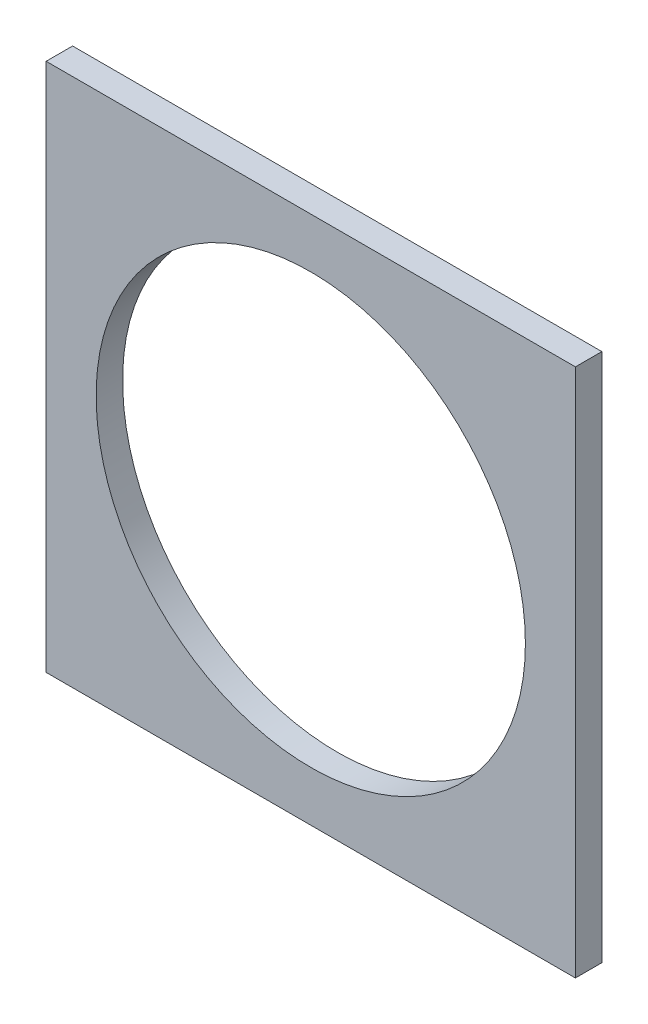
ISO-10303-21;
HEADER;
FILE_DESCRIPTION(('STEP AP214'),'2;1');
FILE_NAME('part.step','',(''),(''),'','','');
FILE_SCHEMA(('AUTOMOTIVE_DESIGN { 1 0 10303 214 1 1 1 1 }'));
ENDSEC;
DATA;
#1=APPLICATION_CONTEXT('core data for automotive mechanical design processes');
#2=APPLICATION_PROTOCOL_DEFINITION('international standard','automotive_design',2000,#1);
#3=PRODUCT_CONTEXT('',#1,'mechanical');
#4=PRODUCT('Part','Part','',(#3));
#5=PRODUCT_RELATED_PRODUCT_CATEGORY('part','',(#4));
#6=PRODUCT_DEFINITION_FORMATION('','',#4);
#7=PRODUCT_DEFINITION_CONTEXT('part definition',#1,'design');
#8=PRODUCT_DEFINITION('design','',#6,#7);
#9=PRODUCT_DEFINITION_SHAPE('','',#8);
#10=(LENGTH_UNIT() NAMED_UNIT(*) SI_UNIT(.MILLI.,.METRE.));
#11=(NAMED_UNIT(*) PLANE_ANGLE_UNIT() SI_UNIT($,.RADIAN.));
#12=(NAMED_UNIT(*) SI_UNIT($,.STERADIAN.) SOLID_ANGLE_UNIT());
#13=UNCERTAINTY_MEASURE_WITH_UNIT(LENGTH_MEASURE(1.E-05),#10,'distance_accuracy_value','');
#14=(GEOMETRIC_REPRESENTATION_CONTEXT(3) GLOBAL_UNCERTAINTY_ASSIGNED_CONTEXT((#13)) GLOBAL_UNIT_ASSIGNED_CONTEXT((#10,
#11,#12)) REPRESENTATION_CONTEXT('',''));
#15=CARTESIAN_POINT('',(0.,0.,0.));
#16=DIRECTION('',(0.,0.,1.));
#17=DIRECTION('',(1.,0.,0.));
#18=AXIS2_PLACEMENT_3D('',#15,#16,#17);
#19=CARTESIAN_POINT('',(63.5,63.5,6.35));
#20=DIRECTION('',(-1.,0.,0.));
#21=DIRECTION('',(0.,-1.,0.));
#22=AXIS2_PLACEMENT_3D('',#19,#20,#21);
#23=PLANE('',#22);
#24=DIRECTION('',(0.,1.,0.));
#25=VECTOR('',#24,1.);
#26=CARTESIAN_POINT('',(63.5,63.5,0.));
#27=LINE('',#26,#25);
#28=CARTESIAN_POINT('',(63.5,-63.5,0.));
#29=VERTEX_POINT('',#28);
#30=CARTESIAN_POINT('',(63.5,63.5,0.));
#31=VERTEX_POINT('',#30);
#32=EDGE_CURVE('E95',#29,#31,#27,.T.);
#33=ORIENTED_EDGE('',*,*,#32,.T.);
#34=DIRECTION('',(0.,0.,-1.));
#35=VECTOR('',#34,1.);
#36=CARTESIAN_POINT('',(63.5,63.5,6.35));
#37=LINE('',#36,#35);
#38=CARTESIAN_POINT('',(63.5,63.5,6.35));
#39=VERTEX_POINT('',#38);
#40=EDGE_CURVE('E11',#39,#31,#37,.T.);
#41=ORIENTED_EDGE('',*,*,#40,.F.);
#42=DIRECTION('',(0.,1.,0.));
#43=VECTOR('',#42,1.);
#44=CARTESIAN_POINT('',(63.5,63.5,6.35));
#45=LINE('',#44,#43);
#46=CARTESIAN_POINT('',(63.5,-63.5,6.35));
#47=VERTEX_POINT('',#46);
#48=EDGE_CURVE('E83',#47,#39,#45,.T.);
#49=ORIENTED_EDGE('',*,*,#48,.F.);
#50=DIRECTION('',(0.,0.,-1.));
#51=VECTOR('',#50,1.);
#52=CARTESIAN_POINT('',(63.5,-63.5,6.35));
#53=LINE('',#52,#51);
#54=EDGE_CURVE('E91',#47,#29,#53,.T.);
#55=ORIENTED_EDGE('',*,*,#54,.T.);
#56=EDGE_LOOP('',(#33,#41,#49,#55));
#57=FACE_BOUND('',#56,.T.);
#58=ADVANCED_FACE('F32',(#57),#23,.F.);
#59=CARTESIAN_POINT('',(-63.5,63.5,6.35));
#60=DIRECTION('',(0.,-1.,0.));
#61=DIRECTION('',(0.,0.,-1.));
#62=AXIS2_PLACEMENT_3D('',#59,#60,#61);
#63=PLANE('',#62);
#64=DIRECTION('',(-1.,0.,0.));
#65=VECTOR('',#64,1.);
#66=CARTESIAN_POINT('',(-63.5,63.5,0.));
#67=LINE('',#66,#65);
#68=CARTESIAN_POINT('',(-63.5,63.5,0.));
#69=VERTEX_POINT('',#68);
#70=EDGE_CURVE('E87',#31,#69,#67,.T.);
#71=ORIENTED_EDGE('',*,*,#70,.T.);
#72=DIRECTION('',(0.,0.,-1.));
#73=VECTOR('',#72,1.);
#74=CARTESIAN_POINT('',(-63.5,63.5,6.35));
#75=LINE('',#74,#73);
#76=CARTESIAN_POINT('',(-63.5,63.5,6.35));
#77=VERTEX_POINT('',#76);
#78=EDGE_CURVE('E40',#77,#69,#75,.T.);
#79=ORIENTED_EDGE('',*,*,#78,.F.);
#80=DIRECTION('',(-1.,0.,0.));
#81=VECTOR('',#80,1.);
#82=CARTESIAN_POINT('',(-63.5,63.5,6.35));
#83=LINE('',#82,#81);
#84=EDGE_CURVE('E78',#39,#77,#83,.T.);
#85=ORIENTED_EDGE('',*,*,#84,.F.);
#86=ORIENTED_EDGE('',*,*,#40,.T.);
#87=EDGE_LOOP('',(#71,#79,#85,#86));
#88=FACE_BOUND('',#87,.T.);
#89=ADVANCED_FACE('F86',(#88),#63,.F.);
#90=CARTESIAN_POINT('',(-63.5,63.5,6.35));
#91=DIRECTION('',(1.,0.,0.));
#92=DIRECTION('',(0.,0.,-1.));
#93=AXIS2_PLACEMENT_3D('',#90,#91,#92);
#94=PLANE('',#93);
#95=DIRECTION('',(0.,-1.,0.));
#96=VECTOR('',#95,1.);
#97=CARTESIAN_POINT('',(-63.5,63.5,0.));
#98=LINE('',#97,#96);
#99=CARTESIAN_POINT('',(-63.5,-63.5,0.));
#100=VERTEX_POINT('',#99);
#101=EDGE_CURVE('E65',#69,#100,#98,.T.);
#102=ORIENTED_EDGE('',*,*,#101,.T.);
#103=DIRECTION('',(0.,0.,-1.));
#104=VECTOR('',#103,1.);
#105=CARTESIAN_POINT('',(-63.5,-63.5,6.35));
#106=LINE('',#105,#104);
#107=CARTESIAN_POINT('',(-63.5,-63.5,6.35));
#108=VERTEX_POINT('',#107);
#109=EDGE_CURVE('E88',#108,#100,#106,.T.);
#110=ORIENTED_EDGE('',*,*,#109,.F.);
#111=DIRECTION('',(0.,-1.,0.));
#112=VECTOR('',#111,1.);
#113=CARTESIAN_POINT('',(-63.5,63.5,6.35));
#114=LINE('',#113,#112);
#115=EDGE_CURVE('E81',#77,#108,#114,.T.);
#116=ORIENTED_EDGE('',*,*,#115,.F.);
#117=ORIENTED_EDGE('',*,*,#78,.T.);
#118=EDGE_LOOP('',(#102,#110,#116,#117));
#119=FACE_BOUND('',#118,.T.);
#120=ADVANCED_FACE('F89',(#119),#94,.F.);
#121=CARTESIAN_POINT('',(-63.5,-63.5,6.35));
#122=DIRECTION('',(0.,1.,0.));
#123=DIRECTION('',(0.,0.,1.));
#124=AXIS2_PLACEMENT_3D('',#121,#122,#123);
#125=PLANE('',#124);
#126=DIRECTION('',(1.,0.,0.));
#127=VECTOR('',#126,1.);
#128=CARTESIAN_POINT('',(-63.5,-63.5,0.));
#129=LINE('',#128,#127);
#130=EDGE_CURVE('E71',#100,#29,#129,.T.);
#131=ORIENTED_EDGE('',*,*,#130,.T.);
#132=ORIENTED_EDGE('',*,*,#54,.F.);
#133=DIRECTION('',(1.,0.,0.));
#134=VECTOR('',#133,1.);
#135=CARTESIAN_POINT('',(-63.5,-63.5,6.35));
#136=LINE('',#135,#134);
#137=EDGE_CURVE('E48',#108,#47,#136,.T.);
#138=ORIENTED_EDGE('',*,*,#137,.F.);
#139=ORIENTED_EDGE('',*,*,#109,.T.);
#140=EDGE_LOOP('',(#131,#132,#138,#139));
#141=FACE_BOUND('',#140,.T.);
#142=ADVANCED_FACE('F103',(#141),#125,.F.);
#143=CARTESIAN_POINT('',(0.,0.,6.35));
#144=DIRECTION('',(0.,0.,1.));
#145=DIRECTION('',(1.,0.,0.));
#146=AXIS2_PLACEMENT_3D('',#143,#144,#145);
#147=PLANE('',#146);
#148=CARTESIAN_POINT('',(0.,0.,6.35));
#149=DIRECTION('',(0.,0.,1.));
#150=DIRECTION('',(1.,0.,0.));
#151=AXIS2_PLACEMENT_3D('',#148,#149,#150);
#152=CIRCLE('',#151,51.5);
#153=CARTESIAN_POINT('',(51.5,0.,6.35));
#154=VERTEX_POINT('',#153);
#155=EDGE_CURVE('E111',#154,#154,#152,.T.);
#156=ORIENTED_EDGE('',*,*,#155,.F.);
#157=EDGE_LOOP('',(#156));
#158=FACE_BOUND('',#157,.T.);
#159=ORIENTED_EDGE('',*,*,#48,.T.);
#160=ORIENTED_EDGE('',*,*,#84,.T.);
#161=ORIENTED_EDGE('',*,*,#115,.T.);
#162=ORIENTED_EDGE('',*,*,#137,.T.);
#163=EDGE_LOOP('',(#159,#160,#161,#162));
#164=FACE_BOUND('',#163,.T.);
#165=ADVANCED_FACE('F79',(#158,#164),#147,.T.);
#166=CARTESIAN_POINT('',(0.,0.,0.));
#167=DIRECTION('',(0.,0.,1.));
#168=DIRECTION('',(1.,0.,0.));
#169=AXIS2_PLACEMENT_3D('',#166,#167,#168);
#170=PLANE('',#169);
#171=CARTESIAN_POINT('',(0.,0.,0.));
#172=DIRECTION('',(0.,0.,1.));
#173=DIRECTION('',(1.,0.,0.));
#174=AXIS2_PLACEMENT_3D('',#171,#172,#173);
#175=CIRCLE('',#174,51.5);
#176=CARTESIAN_POINT('',(51.5,0.,0.));
#177=VERTEX_POINT('',#176);
#178=EDGE_CURVE('E98',#177,#177,#175,.F.);
#179=ORIENTED_EDGE('',*,*,#178,.F.);
#180=EDGE_LOOP('',(#179));
#181=FACE_BOUND('',#180,.T.);
#182=ORIENTED_EDGE('',*,*,#32,.F.);
#183=ORIENTED_EDGE('',*,*,#130,.F.);
#184=ORIENTED_EDGE('',*,*,#101,.F.);
#185=ORIENTED_EDGE('',*,*,#70,.F.);
#186=EDGE_LOOP('',(#182,#183,#184,#185));
#187=FACE_BOUND('',#186,.T.);
#188=ADVANCED_FACE('F106',(#181,#187),#170,.F.);
#189=CARTESIAN_POINT('',(0.,0.,-0.00100000000000013));
#190=DIRECTION('',(0.,0.,1.));
#191=DIRECTION('',(1.,0.,0.));
#192=AXIS2_PLACEMENT_3D('',#189,#190,#191);
#193=CYLINDRICAL_SURFACE('',#192,51.5);
#194=ORIENTED_EDGE('',*,*,#155,.T.);
#195=EDGE_LOOP('',(#194));
#196=FACE_BOUND('',#195,.T.);
#197=ORIENTED_EDGE('',*,*,#178,.T.);
#198=EDGE_LOOP('',(#197));
#199=FACE_BOUND('',#198,.T.);
#200=ADVANCED_FACE('F115',(#196,#199),#193,.F.);
#201=CLOSED_SHELL('',(#58,#89,#120,#142,#165,#188,#200));
#202=MANIFOLD_SOLID_BREP('B2',#201);
#203=ADVANCED_BREP_SHAPE_REPRESENTATION('',(#18,#202),#14);
#204=SHAPE_DEFINITION_REPRESENTATION(#9,#203);
ENDSEC;
END-ISO-10303-21;
